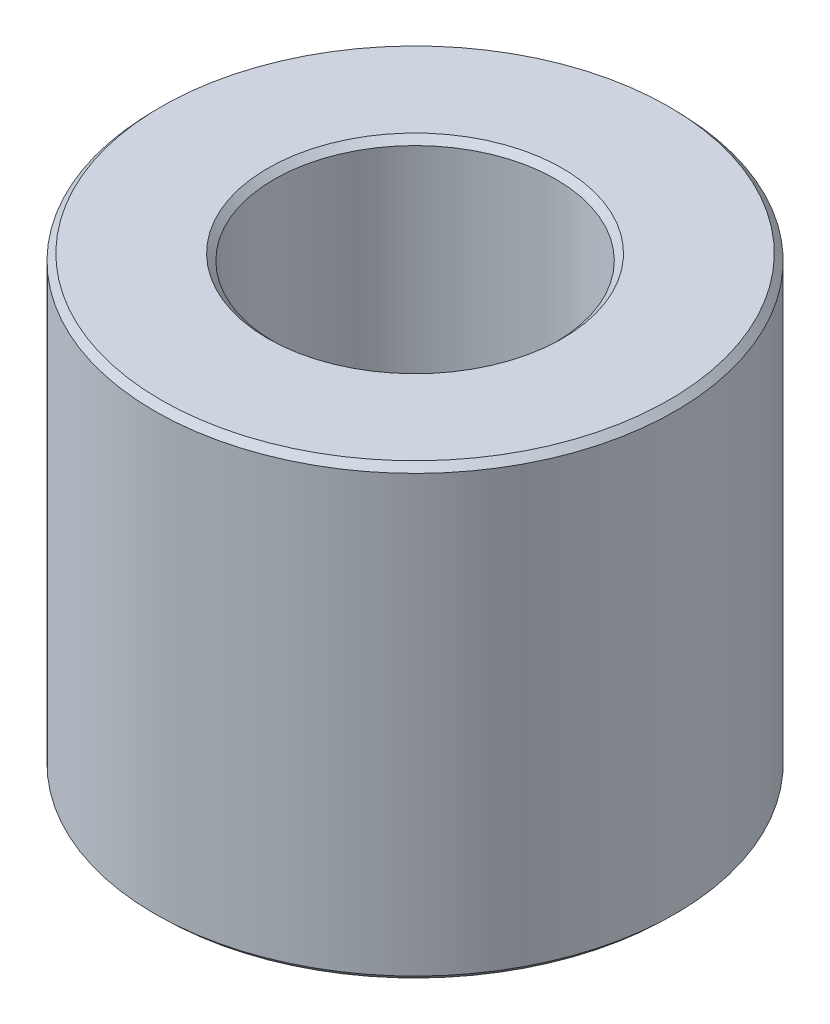
ISO-10303-21;
HEADER;
FILE_DESCRIPTION(('STEP AP214'),'2;1');
FILE_NAME('part.step','',(''),(''),'','','');
FILE_SCHEMA(('AUTOMOTIVE_DESIGN { 1 0 10303 214 1 1 1 1 }'));
ENDSEC;
DATA;
#1=APPLICATION_CONTEXT('core data for automotive mechanical design processes');
#2=APPLICATION_PROTOCOL_DEFINITION('international standard','automotive_design',2000,#1);
#3=PRODUCT_CONTEXT('',#1,'mechanical');
#4=PRODUCT('Part','Part','',(#3));
#5=PRODUCT_RELATED_PRODUCT_CATEGORY('part','',(#4));
#6=PRODUCT_DEFINITION_FORMATION('','',#4);
#7=PRODUCT_DEFINITION_CONTEXT('part definition',#1,'design');
#8=PRODUCT_DEFINITION('design','',#6,#7);
#9=PRODUCT_DEFINITION_SHAPE('','',#8);
#10=(LENGTH_UNIT() NAMED_UNIT(*) SI_UNIT(.MILLI.,.METRE.));
#11=(NAMED_UNIT(*) PLANE_ANGLE_UNIT() SI_UNIT($,.RADIAN.));
#12=(NAMED_UNIT(*) SI_UNIT($,.STERADIAN.) SOLID_ANGLE_UNIT());
#13=UNCERTAINTY_MEASURE_WITH_UNIT(LENGTH_MEASURE(1.E-05),#10,'distance_accuracy_value','');
#14=(GEOMETRIC_REPRESENTATION_CONTEXT(3) GLOBAL_UNCERTAINTY_ASSIGNED_CONTEXT((#13)) GLOBAL_UNIT_ASSIGNED_CONTEXT((#10,
#11,#12)) REPRESENTATION_CONTEXT('',''));
#15=CARTESIAN_POINT('',(0.,0.,0.));
#16=DIRECTION('',(0.,0.,1.));
#17=DIRECTION('',(1.,0.,0.));
#18=AXIS2_PLACEMENT_3D('',#15,#16,#17);
#19=CARTESIAN_POINT('',(0.,77.4788871430118,0.));
#20=DIRECTION('',(0.,-1.,0.));
#21=DIRECTION('',(0.,0.,-1.));
#22=AXIS2_PLACEMENT_3D('',#19,#20,#21);
#23=CYLINDRICAL_SURFACE('',#22,45.);
#24=CARTESIAN_POINT('',(0.,1.08315290859361,0.));
#25=DIRECTION('',(0.,1.,0.));
#26=DIRECTION('',(0.,0.,1.));
#27=AXIS2_PLACEMENT_3D('',#24,#25,#26);
#28=CIRCLE('',#27,45.);
#29=CARTESIAN_POINT('',(0.,1.08315290859361,45.));
#30=VERTEX_POINT('',#29);
#31=EDGE_CURVE('E10',#30,#30,#28,.T.);
#32=ORIENTED_EDGE('',*,*,#31,.T.);
#33=EDGE_LOOP('',(#32));
#34=FACE_BOUND('',#33,.T.);
#35=CARTESIAN_POINT('',(0.,76.3519128775438,0.));
#36=DIRECTION('',(0.,1.,0.));
#37=DIRECTION('',(0.,0.,1.));
#38=AXIS2_PLACEMENT_3D('',#35,#36,#37);
#39=CIRCLE('',#38,45.);
#40=CARTESIAN_POINT('',(0.,76.3519128775438,45.));
#41=VERTEX_POINT('',#40);
#42=EDGE_CURVE('E50',#41,#41,#39,.F.);
#43=ORIENTED_EDGE('',*,*,#42,.T.);
#44=EDGE_LOOP('',(#43));
#45=FACE_BOUND('',#44,.T.);
#46=ADVANCED_FACE('F39',(#34,#45),#23,.T.);
#47=CARTESIAN_POINT('',(0.,77.4788871430118,0.));
#48=DIRECTION('',(0.,1.,0.));
#49=DIRECTION('',(0.,0.,1.));
#50=AXIS2_PLACEMENT_3D('',#47,#48,#49);
#51=PLANE('',#50);
#52=CARTESIAN_POINT('',(0.,77.4788871430118,0.));
#53=DIRECTION('',(0.,1.,0.));
#54=DIRECTION('',(0.,0.,1.));
#55=AXIS2_PLACEMENT_3D('',#52,#53,#54);
#56=CIRCLE('',#55,25.4872684818881);
#57=CARTESIAN_POINT('',(0.,77.4788871430118,25.4872684818881));
#58=VERTEX_POINT('',#57);
#59=EDGE_CURVE('E58',#58,#58,#56,.F.);
#60=ORIENTED_EDGE('',*,*,#59,.T.);
#61=EDGE_LOOP('',(#60));
#62=FACE_BOUND('',#61,.T.);
#63=CARTESIAN_POINT('',(0.,77.4788871430118,0.));
#64=DIRECTION('',(0.,1.,0.));
#65=DIRECTION('',(0.,0.,1.));
#66=AXIS2_PLACEMENT_3D('',#63,#64,#65);
#67=CIRCLE('',#66,43.9168470914063);
#68=CARTESIAN_POINT('',(0.,77.4788871430118,43.9168470914063));
#69=VERTEX_POINT('',#68);
#70=EDGE_CURVE('E61',#69,#69,#67,.T.);
#71=ORIENTED_EDGE('',*,*,#70,.T.);
#72=EDGE_LOOP('',(#71));
#73=FACE_BOUND('',#72,.T.);
#74=ADVANCED_FACE('F88',(#62,#73),#51,.T.);
#75=CARTESIAN_POINT('',(0.,0.,0.));
#76=DIRECTION('',(0.,1.,0.));
#77=DIRECTION('',(0.,0.,1.));
#78=AXIS2_PLACEMENT_3D('',#75,#76,#77);
#79=PLANE('',#78);
#80=CARTESIAN_POINT('',(0.,0.,0.));
#81=DIRECTION('',(0.,1.,0.));
#82=DIRECTION('',(0.,0.,1.));
#83=AXIS2_PLACEMENT_3D('',#80,#81,#82);
#84=CIRCLE('',#83,25.4434471250138);
#85=CARTESIAN_POINT('',(0.,0.,25.4434471250138));
#86=VERTEX_POINT('',#85);
#87=EDGE_CURVE('E51',#86,#86,#84,.T.);
#88=ORIENTED_EDGE('',*,*,#87,.T.);
#89=EDGE_LOOP('',(#88));
#90=FACE_BOUND('',#89,.T.);
#91=CARTESIAN_POINT('',(0.,0.,0.));
#92=DIRECTION('',(0.,1.,0.));
#93=DIRECTION('',(0.,0.,1.));
#94=AXIS2_PLACEMENT_3D('',#91,#92,#93);
#95=CIRCLE('',#94,43.8730257345321);
#96=CARTESIAN_POINT('',(0.,0.,43.8730257345321));
#97=VERTEX_POINT('',#96);
#98=EDGE_CURVE('E54',#97,#97,#95,.F.);
#99=ORIENTED_EDGE('',*,*,#98,.T.);
#100=EDGE_LOOP('',(#99));
#101=FACE_BOUND('',#100,.T.);
#102=ADVANCED_FACE('F83',(#90,#101),#79,.F.);
#103=CARTESIAN_POINT('',(0.,77.4788871430118,0.));
#104=DIRECTION('',(0.,-1.,0.));
#105=DIRECTION('',(0.,0.,-1.));
#106=AXIS2_PLACEMENT_3D('',#103,#104,#105);
#107=CYLINDRICAL_SURFACE('',#106,24.3602942164202);
#108=CARTESIAN_POINT('',(0.,76.3957342344182,0.));
#109=DIRECTION('',(0.,1.,0.));
#110=DIRECTION('',(0.,0.,1.));
#111=AXIS2_PLACEMENT_3D('',#108,#109,#110);
#112=CIRCLE('',#111,24.3602942164202);
#113=CARTESIAN_POINT('',(0.,76.3957342344182,24.3602942164202));
#114=VERTEX_POINT('',#113);
#115=EDGE_CURVE('E67',#114,#114,#112,.T.);
#116=ORIENTED_EDGE('',*,*,#115,.T.);
#117=EDGE_LOOP('',(#116));
#118=FACE_BOUND('',#117,.T.);
#119=CARTESIAN_POINT('',(0.,1.12697426546793,0.));
#120=DIRECTION('',(0.,1.,0.));
#121=DIRECTION('',(0.,0.,1.));
#122=AXIS2_PLACEMENT_3D('',#119,#120,#121);
#123=CIRCLE('',#122,24.3602942164202);
#124=CARTESIAN_POINT('',(0.,1.12697426546793,24.3602942164202));
#125=VERTEX_POINT('',#124);
#126=EDGE_CURVE('E69',#125,#125,#123,.F.);
#127=ORIENTED_EDGE('',*,*,#126,.T.);
#128=EDGE_LOOP('',(#127));
#129=FACE_BOUND('',#128,.T.);
#130=ADVANCED_FACE('F71',(#118,#129),#107,.F.);
#131=CARTESIAN_POINT('',(0.,76.3957342344182,0.));
#132=DIRECTION('',(0.,1.,0.));
#133=DIRECTION('',(0.,0.,1.));
#134=AXIS2_PLACEMENT_3D('',#131,#132,#133);
#135=CONICAL_SURFACE('',#134,24.3602942164202,0.80522309303668);
#136=ORIENTED_EDGE('',*,*,#59,.F.);
#137=EDGE_LOOP('',(#136));
#138=FACE_BOUND('',#137,.T.);
#139=ORIENTED_EDGE('',*,*,#115,.F.);
#140=EDGE_LOOP('',(#139));
#141=FACE_BOUND('',#140,.T.);
#142=ADVANCED_FACE('F77',(#138,#141),#135,.F.);
#143=CARTESIAN_POINT('',(0.,0.,0.));
#144=DIRECTION('',(0.,-1.,0.));
#145=DIRECTION('',(0.,0.,-1.));
#146=AXIS2_PLACEMENT_3D('',#143,#144,#145);
#147=CONICAL_SURFACE('',#146,25.4434471250138,0.765573233758206);
#148=ORIENTED_EDGE('',*,*,#126,.F.);
#149=EDGE_LOOP('',(#148));
#150=FACE_BOUND('',#149,.T.);
#151=ORIENTED_EDGE('',*,*,#87,.F.);
#152=EDGE_LOOP('',(#151));
#153=FACE_BOUND('',#152,.T.);
#154=ADVANCED_FACE('F73',(#150,#153),#147,.F.);
#155=CARTESIAN_POINT('',(0.,1.08315290859361,0.));
#156=DIRECTION('',(0.,1.,0.));
#157=DIRECTION('',(0.,0.,1.));
#158=AXIS2_PLACEMENT_3D('',#155,#156,#157);
#159=CONICAL_SURFACE('',#158,45.,0.805223093036694);
#160=ORIENTED_EDGE('',*,*,#98,.F.);
#161=EDGE_LOOP('',(#160));
#162=FACE_BOUND('',#161,.T.);
#163=ORIENTED_EDGE('',*,*,#31,.F.);
#164=EDGE_LOOP('',(#163));
#165=FACE_BOUND('',#164,.T.);
#166=ADVANCED_FACE('F76',(#162,#165),#159,.T.);
#167=CARTESIAN_POINT('',(0.,77.4788871430118,0.));
#168=DIRECTION('',(0.,-1.,0.));
#169=DIRECTION('',(0.,0.,-1.));
#170=AXIS2_PLACEMENT_3D('',#167,#168,#169);
#171=CONICAL_SURFACE('',#170,43.9168470914063,0.765573233758204);
#172=ORIENTED_EDGE('',*,*,#42,.F.);
#173=EDGE_LOOP('',(#172));
#174=FACE_BOUND('',#173,.T.);
#175=ORIENTED_EDGE('',*,*,#70,.F.);
#176=EDGE_LOOP('',(#175));
#177=FACE_BOUND('',#176,.T.);
#178=ADVANCED_FACE('F45',(#174,#177),#171,.T.);
#179=CLOSED_SHELL('',(#46,#74,#102,#130,#142,#154,#166,#178));
#180=MANIFOLD_SOLID_BREP('B2',#179);
#181=ADVANCED_BREP_SHAPE_REPRESENTATION('',(#18,#180),#14);
#182=SHAPE_DEFINITION_REPRESENTATION(#9,#181);
ENDSEC;
END-ISO-10303-21;
